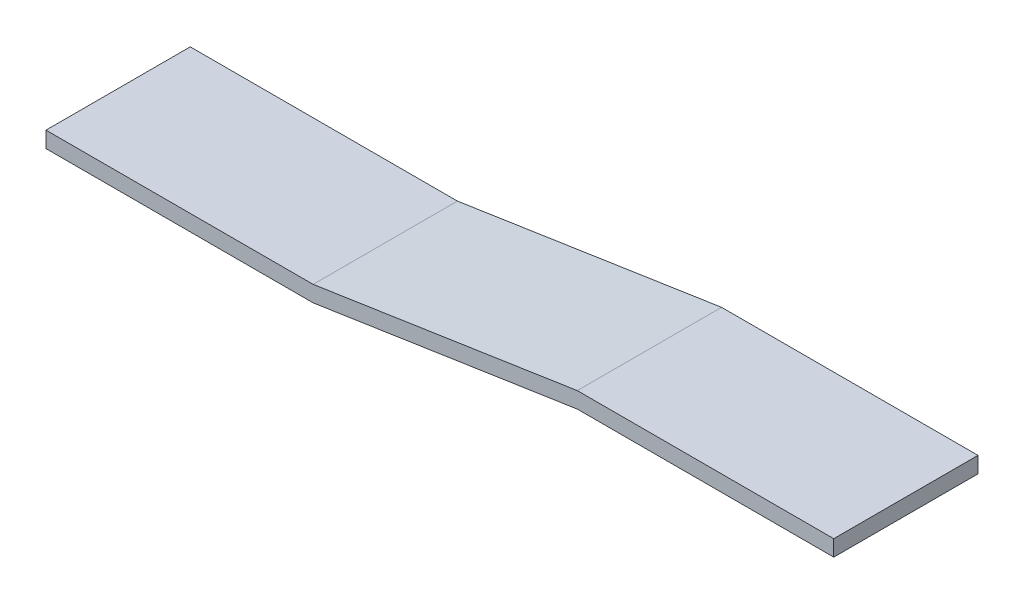
ISO-10303-21;
HEADER;
FILE_DESCRIPTION(('STEP AP214'),'2;1');
FILE_NAME('part.step','',(''),(''),'','','');
FILE_SCHEMA(('AUTOMOTIVE_DESIGN { 1 0 10303 214 1 1 1 1 }'));
ENDSEC;
DATA;
#1=APPLICATION_CONTEXT('core data for automotive mechanical design processes');
#2=APPLICATION_PROTOCOL_DEFINITION('international standard','automotive_design',2000,#1);
#3=PRODUCT_CONTEXT('',#1,'mechanical');
#4=PRODUCT('Part','Part','',(#3));
#5=PRODUCT_RELATED_PRODUCT_CATEGORY('part','',(#4));
#6=PRODUCT_DEFINITION_FORMATION('','',#4);
#7=PRODUCT_DEFINITION_CONTEXT('part definition',#1,'design');
#8=PRODUCT_DEFINITION('design','',#6,#7);
#9=PRODUCT_DEFINITION_SHAPE('','',#8);
#10=(LENGTH_UNIT() NAMED_UNIT(*) SI_UNIT(.MILLI.,.METRE.));
#11=(NAMED_UNIT(*) PLANE_ANGLE_UNIT() SI_UNIT($,.RADIAN.));
#12=(NAMED_UNIT(*) SI_UNIT($,.STERADIAN.) SOLID_ANGLE_UNIT());
#13=UNCERTAINTY_MEASURE_WITH_UNIT(LENGTH_MEASURE(1.E-05),#10,'distance_accuracy_value','');
#14=(GEOMETRIC_REPRESENTATION_CONTEXT(3) GLOBAL_UNCERTAINTY_ASSIGNED_CONTEXT((#13)) GLOBAL_UNIT_ASSIGNED_CONTEXT((#10,
#11,#12)) REPRESENTATION_CONTEXT('',''));
#15=CARTESIAN_POINT('',(0.,0.,0.));
#16=DIRECTION('',(0.,0.,1.));
#17=DIRECTION('',(1.,0.,0.));
#18=AXIS2_PLACEMENT_3D('',#15,#16,#17);
#19=CARTESIAN_POINT('',(24.,1.5,27.));
#20=DIRECTION('',(-1.,0.,0.));
#21=DIRECTION('',(0.,0.,1.));
#22=AXIS2_PLACEMENT_3D('',#19,#20,#21);
#23=PLANE('',#22);
#24=DIRECTION('',(0.,1.,0.));
#25=VECTOR('',#24,1.);
#26=CARTESIAN_POINT('',(24.,1.5,0.));
#27=LINE('',#26,#25);
#28=CARTESIAN_POINT('',(24.,-1.5,0.));
#29=VERTEX_POINT('',#28);
#30=CARTESIAN_POINT('',(24.,1.5,0.));
#31=VERTEX_POINT('',#30);
#32=EDGE_CURVE('E129',#29,#31,#27,.T.);
#33=ORIENTED_EDGE('',*,*,#32,.T.);
#34=DIRECTION('',(0.,0.,-1.));
#35=VECTOR('',#34,1.);
#36=CARTESIAN_POINT('',(24.,1.5,27.));
#37=LINE('',#36,#35);
#38=CARTESIAN_POINT('',(24.,1.5,27.));
#39=VERTEX_POINT('',#38);
#40=EDGE_CURVE('E11',#39,#31,#37,.T.);
#41=ORIENTED_EDGE('',*,*,#40,.F.);
#42=DIRECTION('',(0.,1.,0.));
#43=VECTOR('',#42,1.);
#44=CARTESIAN_POINT('',(24.,1.5,27.));
#45=LINE('',#44,#43);
#46=CARTESIAN_POINT('',(24.,-1.5,27.));
#47=VERTEX_POINT('',#46);
#48=EDGE_CURVE('E143',#47,#39,#45,.T.);
#49=ORIENTED_EDGE('',*,*,#48,.F.);
#50=DIRECTION('',(0.,0.,-1.));
#51=VECTOR('',#50,1.);
#52=CARTESIAN_POINT('',(24.,-1.5,27.));
#53=LINE('',#52,#51);
#54=EDGE_CURVE('E125',#47,#29,#53,.T.);
#55=ORIENTED_EDGE('',*,*,#54,.T.);
#56=EDGE_LOOP('',(#33,#41,#49,#55));
#57=FACE_BOUND('',#56,.T.);
#58=ADVANCED_FACE('F33',(#57),#23,.F.);
#59=CARTESIAN_POINT('',(-24.,1.5,27.));
#60=DIRECTION('',(0.,-1.,0.));
#61=DIRECTION('',(1.,0.,0.));
#62=AXIS2_PLACEMENT_3D('',#59,#60,#61);
#63=PLANE('',#62);
#64=DIRECTION('',(-1.,0.,0.));
#65=VECTOR('',#64,1.);
#66=CARTESIAN_POINT('',(-24.,1.5,0.));
#67=LINE('',#66,#65);
#68=CARTESIAN_POINT('',(-24.,1.5,0.));
#69=VERTEX_POINT('',#68);
#70=EDGE_CURVE('E132',#31,#69,#67,.T.);
#71=ORIENTED_EDGE('',*,*,#70,.T.);
#72=DIRECTION('',(0.,0.,-1.));
#73=VECTOR('',#72,1.);
#74=CARTESIAN_POINT('',(-24.,1.5,27.));
#75=LINE('',#74,#73);
#76=CARTESIAN_POINT('',(-24.,1.5,27.));
#77=VERTEX_POINT('',#76);
#78=EDGE_CURVE('E41',#77,#69,#75,.T.);
#79=ORIENTED_EDGE('',*,*,#78,.F.);
#80=DIRECTION('',(-1.,0.,0.));
#81=VECTOR('',#80,1.);
#82=CARTESIAN_POINT('',(-24.,1.5,27.));
#83=LINE('',#82,#81);
#84=EDGE_CURVE('E92',#39,#77,#83,.T.);
#85=ORIENTED_EDGE('',*,*,#84,.F.);
#86=ORIENTED_EDGE('',*,*,#40,.T.);
#87=EDGE_LOOP('',(#71,#79,#85,#86));
#88=FACE_BOUND('',#87,.T.);
#89=ADVANCED_FACE('F178',(#88),#63,.F.);
#90=CARTESIAN_POINT('',(-73.434299833213,-5.99999999999999,27.));
#91=DIRECTION('',(0.15,-0.988685996664259,0.));
#92=DIRECTION('',(0.98868599666426,0.15,0.));
#93=AXIS2_PLACEMENT_3D('',#90,#91,#92);
#94=PLANE('',#93);
#95=DIRECTION('',(-0.98868599666426,-0.15,0.));
#96=VECTOR('',#95,1.);
#97=CARTESIAN_POINT('',(-73.434299833213,-5.99999999999999,0.));
#98=LINE('',#97,#96);
#99=CARTESIAN_POINT('',(-73.434299833213,-5.99999999999999,0.));
#100=VERTEX_POINT('',#99);
#101=EDGE_CURVE('E134',#69,#100,#98,.T.);
#102=ORIENTED_EDGE('',*,*,#101,.T.);
#103=DIRECTION('',(0.,0.,-1.));
#104=VECTOR('',#103,1.);
#105=CARTESIAN_POINT('',(-73.434299833213,-5.99999999999999,27.));
#106=LINE('',#105,#104);
#107=CARTESIAN_POINT('',(-73.434299833213,-5.99999999999999,27.));
#108=VERTEX_POINT('',#107);
#109=EDGE_CURVE('E150',#108,#100,#106,.T.);
#110=ORIENTED_EDGE('',*,*,#109,.F.);
#111=DIRECTION('',(-0.98868599666426,-0.15,0.));
#112=VECTOR('',#111,1.);
#113=CARTESIAN_POINT('',(-73.434299833213,-5.99999999999999,27.));
#114=LINE('',#113,#112);
#115=EDGE_CURVE('E158',#77,#108,#114,.T.);
#116=ORIENTED_EDGE('',*,*,#115,.F.);
#117=ORIENTED_EDGE('',*,*,#78,.T.);
#118=EDGE_LOOP('',(#102,#110,#116,#117));
#119=FACE_BOUND('',#118,.T.);
#120=ADVANCED_FACE('F156',(#119),#94,.F.);
#121=CARTESIAN_POINT('',(-73.434299833213,-5.99999999999999,27.));
#122=DIRECTION('',(0.,-1.,0.));
#123=DIRECTION('',(1.,0.,0.));
#124=AXIS2_PLACEMENT_3D('',#121,#122,#123);
#125=PLANE('',#124);
#126=DIRECTION('',(-1.,0.,0.));
#127=VECTOR('',#126,1.);
#128=CARTESIAN_POINT('',(-73.434299833213,-5.99999999999999,0.));
#129=LINE('',#128,#127);
#130=CARTESIAN_POINT('',(-123.434299833213,-6.,0.));
#131=VERTEX_POINT('',#130);
#132=EDGE_CURVE('E136',#100,#131,#129,.T.);
#133=ORIENTED_EDGE('',*,*,#132,.T.);
#134=DIRECTION('',(0.,0.,-1.));
#135=VECTOR('',#134,1.);
#136=CARTESIAN_POINT('',(-123.434299833213,-6.,27.));
#137=LINE('',#136,#135);
#138=CARTESIAN_POINT('',(-123.434299833213,-6.,27.));
#139=VERTEX_POINT('',#138);
#140=EDGE_CURVE('E147',#139,#131,#137,.T.);
#141=ORIENTED_EDGE('',*,*,#140,.F.);
#142=DIRECTION('',(-1.,0.,0.));
#143=VECTOR('',#142,1.);
#144=CARTESIAN_POINT('',(-73.434299833213,-5.99999999999999,27.));
#145=LINE('',#144,#143);
#146=EDGE_CURVE('E170',#108,#139,#145,.T.);
#147=ORIENTED_EDGE('',*,*,#146,.F.);
#148=ORIENTED_EDGE('',*,*,#109,.T.);
#149=EDGE_LOOP('',(#133,#141,#147,#148));
#150=FACE_BOUND('',#149,.T.);
#151=ADVANCED_FACE('F166',(#150),#125,.F.);
#152=CARTESIAN_POINT('',(-123.434299833213,-6.,27.));
#153=DIRECTION('',(1.,0.,0.));
#154=DIRECTION('',(0.,0.,-1.));
#155=AXIS2_PLACEMENT_3D('',#152,#153,#154);
#156=PLANE('',#155);
#157=DIRECTION('',(0.,-1.,0.));
#158=VECTOR('',#157,1.);
#159=CARTESIAN_POINT('',(-123.434299833213,-6.,0.));
#160=LINE('',#159,#158);
#161=CARTESIAN_POINT('',(-123.434299833213,-9.,0.));
#162=VERTEX_POINT('',#161);
#163=EDGE_CURVE('E138',#131,#162,#160,.T.);
#164=ORIENTED_EDGE('',*,*,#163,.T.);
#165=DIRECTION('',(0.,0.,-1.));
#166=VECTOR('',#165,1.);
#167=CARTESIAN_POINT('',(-123.434299833213,-9.,27.));
#168=LINE('',#167,#166);
#169=CARTESIAN_POINT('',(-123.434299833213,-9.,27.));
#170=VERTEX_POINT('',#169);
#171=EDGE_CURVE('E120',#170,#162,#168,.T.);
#172=ORIENTED_EDGE('',*,*,#171,.F.);
#173=DIRECTION('',(0.,-1.,0.));
#174=VECTOR('',#173,1.);
#175=CARTESIAN_POINT('',(-123.434299833213,-6.,27.));
#176=LINE('',#175,#174);
#177=EDGE_CURVE('E111',#139,#170,#176,.T.);
#178=ORIENTED_EDGE('',*,*,#177,.F.);
#179=ORIENTED_EDGE('',*,*,#140,.T.);
#180=EDGE_LOOP('',(#164,#172,#178,#179));
#181=FACE_BOUND('',#180,.T.);
#182=ADVANCED_FACE('F169',(#181),#156,.F.);
#183=CARTESIAN_POINT('',(-123.434299833213,-9.,27.));
#184=DIRECTION('',(0.,1.,0.));
#185=DIRECTION('',(0.,0.,1.));
#186=AXIS2_PLACEMENT_3D('',#183,#184,#185);
#187=PLANE('',#186);
#188=DIRECTION('',(1.,0.,0.));
#189=VECTOR('',#188,1.);
#190=CARTESIAN_POINT('',(-123.434299833213,-9.,0.));
#191=LINE('',#190,#189);
#192=CARTESIAN_POINT('',(-73.434299833213,-9.,0.));
#193=VERTEX_POINT('',#192);
#194=EDGE_CURVE('E119',#162,#193,#191,.T.);
#195=ORIENTED_EDGE('',*,*,#194,.T.);
#196=DIRECTION('',(0.,0.,-1.));
#197=VECTOR('',#196,1.);
#198=CARTESIAN_POINT('',(-73.434299833213,-9.,27.));
#199=LINE('',#198,#197);
#200=CARTESIAN_POINT('',(-73.434299833213,-9.,27.));
#201=VERTEX_POINT('',#200);
#202=EDGE_CURVE('E116',#201,#193,#199,.T.);
#203=ORIENTED_EDGE('',*,*,#202,.F.);
#204=DIRECTION('',(1.,0.,0.));
#205=VECTOR('',#204,1.);
#206=CARTESIAN_POINT('',(-123.434299833213,-9.,27.));
#207=LINE('',#206,#205);
#208=EDGE_CURVE('E105',#170,#201,#207,.T.);
#209=ORIENTED_EDGE('',*,*,#208,.F.);
#210=ORIENTED_EDGE('',*,*,#171,.T.);
#211=EDGE_LOOP('',(#195,#203,#209,#210));
#212=FACE_BOUND('',#211,.T.);
#213=ADVANCED_FACE('F117',(#212),#187,.F.);
#214=CARTESIAN_POINT('',(-24.,-1.5,27.));
#215=DIRECTION('',(-0.15,0.988685996664259,0.));
#216=DIRECTION('',(-0.98868599666426,-0.15,0.));
#217=AXIS2_PLACEMENT_3D('',#214,#215,#216);
#218=PLANE('',#217);
#219=DIRECTION('',(0.98868599666426,0.15,0.));
#220=VECTOR('',#219,1.);
#221=CARTESIAN_POINT('',(-24.,-1.5,0.));
#222=LINE('',#221,#220);
#223=CARTESIAN_POINT('',(-24.,-1.5,0.));
#224=VERTEX_POINT('',#223);
#225=EDGE_CURVE('E78',#193,#224,#222,.T.);
#226=ORIENTED_EDGE('',*,*,#225,.T.);
#227=DIRECTION('',(0.,0.,-1.));
#228=VECTOR('',#227,1.);
#229=CARTESIAN_POINT('',(-24.,-1.5,27.));
#230=LINE('',#229,#228);
#231=CARTESIAN_POINT('',(-24.,-1.5,27.));
#232=VERTEX_POINT('',#231);
#233=EDGE_CURVE('E121',#232,#224,#230,.T.);
#234=ORIENTED_EDGE('',*,*,#233,.F.);
#235=DIRECTION('',(0.98868599666426,0.15,0.));
#236=VECTOR('',#235,1.);
#237=CARTESIAN_POINT('',(-24.,-1.5,27.));
#238=LINE('',#237,#236);
#239=EDGE_CURVE('E109',#201,#232,#238,.T.);
#240=ORIENTED_EDGE('',*,*,#239,.F.);
#241=ORIENTED_EDGE('',*,*,#202,.T.);
#242=EDGE_LOOP('',(#226,#234,#240,#241));
#243=FACE_BOUND('',#242,.T.);
#244=ADVANCED_FACE('F123',(#243),#218,.F.);
#245=CARTESIAN_POINT('',(-24.,-1.5,27.));
#246=DIRECTION('',(0.,1.,0.));
#247=DIRECTION('',(0.,0.,1.));
#248=AXIS2_PLACEMENT_3D('',#245,#246,#247);
#249=PLANE('',#248);
#250=DIRECTION('',(1.,0.,0.));
#251=VECTOR('',#250,1.);
#252=CARTESIAN_POINT('',(-24.,-1.5,0.));
#253=LINE('',#252,#251);
#254=EDGE_CURVE('E84',#224,#29,#253,.T.);
#255=ORIENTED_EDGE('',*,*,#254,.T.);
#256=ORIENTED_EDGE('',*,*,#54,.F.);
#257=DIRECTION('',(1.,0.,0.));
#258=VECTOR('',#257,1.);
#259=CARTESIAN_POINT('',(-24.,-1.5,27.));
#260=LINE('',#259,#258);
#261=EDGE_CURVE('E49',#232,#47,#260,.T.);
#262=ORIENTED_EDGE('',*,*,#261,.F.);
#263=ORIENTED_EDGE('',*,*,#233,.T.);
#264=EDGE_LOOP('',(#255,#256,#262,#263));
#265=FACE_BOUND('',#264,.T.);
#266=ADVANCED_FACE('F194',(#265),#249,.F.);
#267=CARTESIAN_POINT('',(0.,0.,27.));
#268=DIRECTION('',(0.,0.,1.));
#269=DIRECTION('',(1.,0.,0.));
#270=AXIS2_PLACEMENT_3D('',#267,#268,#269);
#271=PLANE('',#270);
#272=ORIENTED_EDGE('',*,*,#48,.T.);
#273=ORIENTED_EDGE('',*,*,#84,.T.);
#274=ORIENTED_EDGE('',*,*,#115,.T.);
#275=ORIENTED_EDGE('',*,*,#146,.T.);
#276=ORIENTED_EDGE('',*,*,#177,.T.);
#277=ORIENTED_EDGE('',*,*,#208,.T.);
#278=ORIENTED_EDGE('',*,*,#239,.T.);
#279=ORIENTED_EDGE('',*,*,#261,.T.);
#280=EDGE_LOOP('',(#272,#273,#274,#275,#276,#277,#278,#279));
#281=FACE_BOUND('',#280,.T.);
#282=ADVANCED_FACE('F107',(#281),#271,.T.);
#283=CARTESIAN_POINT('',(0.,0.,0.));
#284=DIRECTION('',(0.,0.,1.));
#285=DIRECTION('',(1.,0.,0.));
#286=AXIS2_PLACEMENT_3D('',#283,#284,#285);
#287=PLANE('',#286);
#288=ORIENTED_EDGE('',*,*,#32,.F.);
#289=ORIENTED_EDGE('',*,*,#254,.F.);
#290=ORIENTED_EDGE('',*,*,#225,.F.);
#291=ORIENTED_EDGE('',*,*,#194,.F.);
#292=ORIENTED_EDGE('',*,*,#163,.F.);
#293=ORIENTED_EDGE('',*,*,#132,.F.);
#294=ORIENTED_EDGE('',*,*,#101,.F.);
#295=ORIENTED_EDGE('',*,*,#70,.F.);
#296=EDGE_LOOP('',(#288,#289,#290,#291,#292,#293,#294,#295));
#297=FACE_BOUND('',#296,.T.);
#298=ADVANCED_FACE('F162',(#297),#287,.F.);
#299=CLOSED_SHELL('',(#58,#89,#120,#151,#182,#213,#244,#266,#282,#298));
#300=MANIFOLD_SOLID_BREP('B2',#299);
#301=ADVANCED_BREP_SHAPE_REPRESENTATION('',(#18,#300),#14);
#302=SHAPE_DEFINITION_REPRESENTATION(#9,#301);
ENDSEC;
END-ISO-10303-21;
